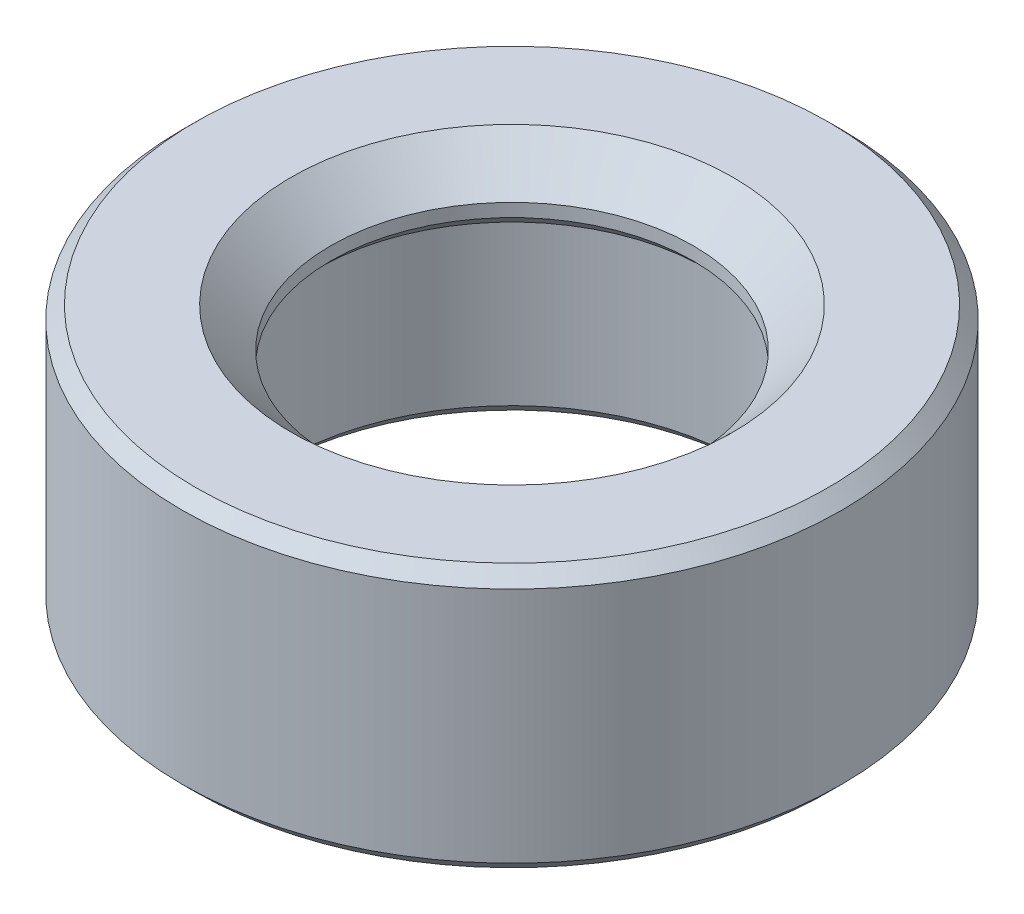
ISO-10303-21;
HEADER;
FILE_DESCRIPTION(('STEP AP214'),'2;1');
FILE_NAME('part.step','',(''),(''),'','','');
FILE_SCHEMA(('AUTOMOTIVE_DESIGN { 1 0 10303 214 1 1 1 1 }'));
ENDSEC;
DATA;
#1=APPLICATION_CONTEXT('core data for automotive mechanical design processes');
#2=APPLICATION_PROTOCOL_DEFINITION('international standard','automotive_design',2000,#1);
#3=PRODUCT_CONTEXT('',#1,'mechanical');
#4=PRODUCT('Part','Part','',(#3));
#5=PRODUCT_RELATED_PRODUCT_CATEGORY('part','',(#4));
#6=PRODUCT_DEFINITION_FORMATION('','',#4);
#7=PRODUCT_DEFINITION_CONTEXT('part definition',#1,'design');
#8=PRODUCT_DEFINITION('design','',#6,#7);
#9=PRODUCT_DEFINITION_SHAPE('','',#8);
#10=(LENGTH_UNIT() NAMED_UNIT(*) SI_UNIT(.MILLI.,.METRE.));
#11=(NAMED_UNIT(*) PLANE_ANGLE_UNIT() SI_UNIT($,.RADIAN.));
#12=(NAMED_UNIT(*) SI_UNIT($,.STERADIAN.) SOLID_ANGLE_UNIT());
#13=UNCERTAINTY_MEASURE_WITH_UNIT(LENGTH_MEASURE(1.E-05),#10,'distance_accuracy_value','');
#14=(GEOMETRIC_REPRESENTATION_CONTEXT(3) GLOBAL_UNCERTAINTY_ASSIGNED_CONTEXT((#13)) GLOBAL_UNIT_ASSIGNED_CONTEXT((#10,
#11,#12)) REPRESENTATION_CONTEXT('',''));
#15=CARTESIAN_POINT('',(0.,0.,0.));
#16=DIRECTION('',(0.,0.,1.));
#17=DIRECTION('',(1.,0.,0.));
#18=AXIS2_PLACEMENT_3D('',#15,#16,#17);
#19=CARTESIAN_POINT('',(0.,-2.,-5.));
#20=DIRECTION('',(0.,1.,0.));
#21=DIRECTION('',(0.,0.,1.));
#22=AXIS2_PLACEMENT_3D('',#19,#20,#21);
#23=PLANE('',#22);
#24=CARTESIAN_POINT('',(0.,-2.,0.));
#25=DIRECTION('',(0.,1.,0.));
#26=DIRECTION('',(0.,0.,1.));
#27=AXIS2_PLACEMENT_3D('',#24,#25,#26);
#28=CIRCLE('',#27,3.70000000000001);
#29=CARTESIAN_POINT('',(0.,-2.,3.70000000000001));
#30=VERTEX_POINT('',#29);
#31=EDGE_CURVE('E61',#30,#30,#28,.T.);
#32=ORIENTED_EDGE('',*,*,#31,.T.);
#33=EDGE_LOOP('',(#32));
#34=FACE_BOUND('',#33,.T.);
#35=CARTESIAN_POINT('',(0.,-2.,0.));
#36=DIRECTION('',(0.,1.,0.));
#37=DIRECTION('',(0.,0.,1.));
#38=AXIS2_PLACEMENT_3D('',#35,#36,#37);
#39=CIRCLE('',#38,4.8);
#40=CARTESIAN_POINT('',(0.,-2.,4.8));
#41=VERTEX_POINT('',#40);
#42=EDGE_CURVE('E64',#41,#41,#39,.F.);
#43=ORIENTED_EDGE('',*,*,#42,.T.);
#44=EDGE_LOOP('',(#43));
#45=FACE_BOUND('',#44,.T.);
#46=ADVANCED_FACE('F35',(#34,#45),#23,.F.);
#47=CARTESIAN_POINT('',(0.,14.1930379746836,0.));
#48=DIRECTION('',(0.,1.,0.));
#49=DIRECTION('',(0.,0.,1.));
#50=AXIS2_PLACEMENT_3D('',#47,#48,#49);
#51=CYLINDRICAL_SURFACE('',#50,3.5);
#52=CARTESIAN_POINT('',(0.,-1.8,0.));
#53=DIRECTION('',(0.,1.,0.));
#54=DIRECTION('',(0.,0.,1.));
#55=AXIS2_PLACEMENT_3D('',#52,#53,#54);
#56=CIRCLE('',#55,3.5);
#57=CARTESIAN_POINT('',(0.,-1.8,3.5));
#58=VERTEX_POINT('',#57);
#59=EDGE_CURVE('E58',#58,#58,#56,.F.);
#60=ORIENTED_EDGE('',*,*,#59,.T.);
#61=EDGE_LOOP('',(#60));
#62=FACE_BOUND('',#61,.T.);
#63=CARTESIAN_POINT('',(0.,1.,0.));
#64=DIRECTION('',(0.,1.,0.));
#65=DIRECTION('',(0.,0.,1.));
#66=AXIS2_PLACEMENT_3D('',#63,#64,#65);
#67=CIRCLE('',#66,3.5);
#68=CARTESIAN_POINT('',(0.,1.,3.5));
#69=VERTEX_POINT('',#68);
#70=EDGE_CURVE('E73',#69,#69,#67,.T.);
#71=ORIENTED_EDGE('',*,*,#70,.T.);
#72=EDGE_LOOP('',(#71));
#73=FACE_BOUND('',#72,.T.);
#74=ADVANCED_FACE('F77',(#62,#73),#51,.F.);
#75=CARTESIAN_POINT('',(0.,1.,-3.5));
#76=DIRECTION('',(0.,1.,0.));
#77=DIRECTION('',(0.,0.,1.));
#78=AXIS2_PLACEMENT_3D('',#75,#76,#77);
#79=PLANE('',#78);
#80=CARTESIAN_POINT('',(0.,1.,0.));
#81=DIRECTION('',(0.,1.,0.));
#82=DIRECTION('',(0.,0.,1.));
#83=AXIS2_PLACEMENT_3D('',#80,#81,#82);
#84=CIRCLE('',#83,2.95000000000001);
#85=CARTESIAN_POINT('',(0.,1.,2.95000000000001));
#86=VERTEX_POINT('',#85);
#87=EDGE_CURVE('E70',#86,#86,#84,.T.);
#88=ORIENTED_EDGE('',*,*,#87,.T.);
#89=EDGE_LOOP('',(#88));
#90=FACE_BOUND('',#89,.T.);
#91=ORIENTED_EDGE('',*,*,#70,.F.);
#92=EDGE_LOOP('',(#91));
#93=FACE_BOUND('',#92,.T.);
#94=ADVANCED_FACE('F79',(#90,#93),#79,.F.);
#95=CARTESIAN_POINT('',(0.,14.1930379746836,0.));
#96=DIRECTION('',(0.,1.,0.));
#97=DIRECTION('',(0.,0.,1.));
#98=AXIS2_PLACEMENT_3D('',#95,#96,#97);
#99=CYLINDRICAL_SURFACE('',#98,2.75);
#100=CARTESIAN_POINT('',(0.,1.4,0.));
#101=DIRECTION('',(0.,-1.,0.));
#102=DIRECTION('',(0.,0.,-1.));
#103=AXIS2_PLACEMENT_3D('',#100,#101,#102);
#104=CIRCLE('',#103,2.75);
#105=CARTESIAN_POINT('',(0.,1.4,-2.75));
#106=VERTEX_POINT('',#105);
#107=EDGE_CURVE('E42',#106,#106,#104,.F.);
#108=ORIENTED_EDGE('',*,*,#107,.T.);
#109=EDGE_LOOP('',(#108));
#110=FACE_BOUND('',#109,.T.);
#111=CARTESIAN_POINT('',(0.,1.2,0.));
#112=DIRECTION('',(0.,1.,0.));
#113=DIRECTION('',(0.,0.,1.));
#114=AXIS2_PLACEMENT_3D('',#111,#112,#113);
#115=CIRCLE('',#114,2.75);
#116=CARTESIAN_POINT('',(0.,1.2,2.75));
#117=VERTEX_POINT('',#116);
#118=EDGE_CURVE('E67',#117,#117,#115,.F.);
#119=ORIENTED_EDGE('',*,*,#118,.T.);
#120=EDGE_LOOP('',(#119));
#121=FACE_BOUND('',#120,.T.);
#122=ADVANCED_FACE('F81',(#110,#121),#99,.F.);
#123=CARTESIAN_POINT('',(0.,2.,-2.75));
#124=DIRECTION('',(0.,-1.,0.));
#125=DIRECTION('',(0.,0.,-1.));
#126=AXIS2_PLACEMENT_3D('',#123,#124,#125);
#127=PLANE('',#126);
#128=CARTESIAN_POINT('',(0.,2.,0.));
#129=DIRECTION('',(0.,-1.,0.));
#130=DIRECTION('',(0.,0.,-1.));
#131=AXIS2_PLACEMENT_3D('',#128,#129,#130);
#132=CIRCLE('',#131,3.35);
#133=CARTESIAN_POINT('',(0.,2.,-3.35));
#134=VERTEX_POINT('',#133);
#135=EDGE_CURVE('E10',#134,#134,#132,.T.);
#136=ORIENTED_EDGE('',*,*,#135,.T.);
#137=EDGE_LOOP('',(#136));
#138=FACE_BOUND('',#137,.T.);
#139=CARTESIAN_POINT('',(0.,2.,0.));
#140=DIRECTION('',(0.,-1.,0.));
#141=DIRECTION('',(0.,0.,-1.));
#142=AXIS2_PLACEMENT_3D('',#139,#140,#141);
#143=CIRCLE('',#142,4.8);
#144=CARTESIAN_POINT('',(0.,2.,-4.8));
#145=VERTEX_POINT('',#144);
#146=EDGE_CURVE('E46',#145,#145,#143,.F.);
#147=ORIENTED_EDGE('',*,*,#146,.T.);
#148=EDGE_LOOP('',(#147));
#149=FACE_BOUND('',#148,.T.);
#150=ADVANCED_FACE('F88',(#138,#149),#127,.F.);
#151=CARTESIAN_POINT('',(0.,14.1930379746836,0.));
#152=DIRECTION('',(0.,1.,0.));
#153=DIRECTION('',(0.,0.,1.));
#154=AXIS2_PLACEMENT_3D('',#151,#152,#153);
#155=CYLINDRICAL_SURFACE('',#154,5.);
#156=CARTESIAN_POINT('',(0.,-1.8,0.));
#157=DIRECTION('',(0.,1.,0.));
#158=DIRECTION('',(0.,0.,1.));
#159=AXIS2_PLACEMENT_3D('',#156,#157,#158);
#160=CIRCLE('',#159,5.);
#161=CARTESIAN_POINT('',(0.,-1.8,5.));
#162=VERTEX_POINT('',#161);
#163=EDGE_CURVE('E50',#162,#162,#160,.T.);
#164=ORIENTED_EDGE('',*,*,#163,.T.);
#165=EDGE_LOOP('',(#164));
#166=FACE_BOUND('',#165,.T.);
#167=CARTESIAN_POINT('',(0.,1.8,0.));
#168=DIRECTION('',(0.,-1.,0.));
#169=DIRECTION('',(0.,0.,-1.));
#170=AXIS2_PLACEMENT_3D('',#167,#168,#169);
#171=CIRCLE('',#170,5.);
#172=CARTESIAN_POINT('',(0.,1.8,-5.));
#173=VERTEX_POINT('',#172);
#174=EDGE_CURVE('E55',#173,#173,#171,.T.);
#175=ORIENTED_EDGE('',*,*,#174,.T.);
#176=EDGE_LOOP('',(#175));
#177=FACE_BOUND('',#176,.T.);
#178=ADVANCED_FACE('F103',(#166,#177),#155,.T.);
#179=CARTESIAN_POINT('',(0.,1.,0.));
#180=DIRECTION('',(0.,-1.,0.));
#181=DIRECTION('',(0.,0.,-1.));
#182=AXIS2_PLACEMENT_3D('',#179,#180,#181);
#183=CONICAL_SURFACE('',#182,2.95,0.78539816339745);
#184=ORIENTED_EDGE('',*,*,#118,.F.);
#185=EDGE_LOOP('',(#184));
#186=FACE_BOUND('',#185,.T.);
#187=ORIENTED_EDGE('',*,*,#87,.F.);
#188=EDGE_LOOP('',(#187));
#189=FACE_BOUND('',#188,.T.);
#190=ADVANCED_FACE('F99',(#186,#189),#183,.F.);
#191=CARTESIAN_POINT('',(0.,-2.,0.));
#192=DIRECTION('',(0.,-1.,0.));
#193=DIRECTION('',(0.,0.,-1.));
#194=AXIS2_PLACEMENT_3D('',#191,#192,#193);
#195=CONICAL_SURFACE('',#194,3.70000000000001,0.785398163397454);
#196=ORIENTED_EDGE('',*,*,#59,.F.);
#197=EDGE_LOOP('',(#196));
#198=FACE_BOUND('',#197,.T.);
#199=ORIENTED_EDGE('',*,*,#31,.F.);
#200=EDGE_LOOP('',(#199));
#201=FACE_BOUND('',#200,.T.);
#202=ADVANCED_FACE('F102',(#198,#201),#195,.F.);
#203=CARTESIAN_POINT('',(0.,-1.8,0.));
#204=DIRECTION('',(0.,1.,0.));
#205=DIRECTION('',(0.,0.,1.));
#206=AXIS2_PLACEMENT_3D('',#203,#204,#205);
#207=CONICAL_SURFACE('',#206,5.,0.78539816339745);
#208=ORIENTED_EDGE('',*,*,#42,.F.);
#209=EDGE_LOOP('',(#208));
#210=FACE_BOUND('',#209,.T.);
#211=ORIENTED_EDGE('',*,*,#163,.F.);
#212=EDGE_LOOP('',(#211));
#213=FACE_BOUND('',#212,.T.);
#214=ADVANCED_FACE('F107',(#210,#213),#207,.T.);
#215=CARTESIAN_POINT('',(0.,2.,0.));
#216=DIRECTION('',(0.,-1.,0.));
#217=DIRECTION('',(0.,0.,-1.));
#218=AXIS2_PLACEMENT_3D('',#215,#216,#217);
#219=CONICAL_SURFACE('',#218,4.8,0.78539816339744);
#220=ORIENTED_EDGE('',*,*,#174,.F.);
#221=EDGE_LOOP('',(#220));
#222=FACE_BOUND('',#221,.T.);
#223=ORIENTED_EDGE('',*,*,#146,.F.);
#224=EDGE_LOOP('',(#223));
#225=FACE_BOUND('',#224,.T.);
#226=ADVANCED_FACE('F110',(#222,#225),#219,.T.);
#227=CARTESIAN_POINT('',(0.,1.4,0.));
#228=DIRECTION('',(0.,1.,0.));
#229=DIRECTION('',(0.,0.,1.));
#230=AXIS2_PLACEMENT_3D('',#227,#228,#229);
#231=CONICAL_SURFACE('',#230,2.75,0.78539816339745);
#232=ORIENTED_EDGE('',*,*,#135,.F.);
#233=EDGE_LOOP('',(#232));
#234=FACE_BOUND('',#233,.T.);
#235=ORIENTED_EDGE('',*,*,#107,.F.);
#236=EDGE_LOOP('',(#235));
#237=FACE_BOUND('',#236,.T.);
#238=ADVANCED_FACE('F37',(#234,#237),#231,.F.);
#239=CLOSED_SHELL('',(#46,#74,#94,#122,#150,#178,#190,#202,#214,#226,#238));
#240=MANIFOLD_SOLID_BREP('B2',#239);
#241=ADVANCED_BREP_SHAPE_REPRESENTATION('',(#18,#240),#14);
#242=SHAPE_DEFINITION_REPRESENTATION(#9,#241);
ENDSEC;
END-ISO-10303-21;
